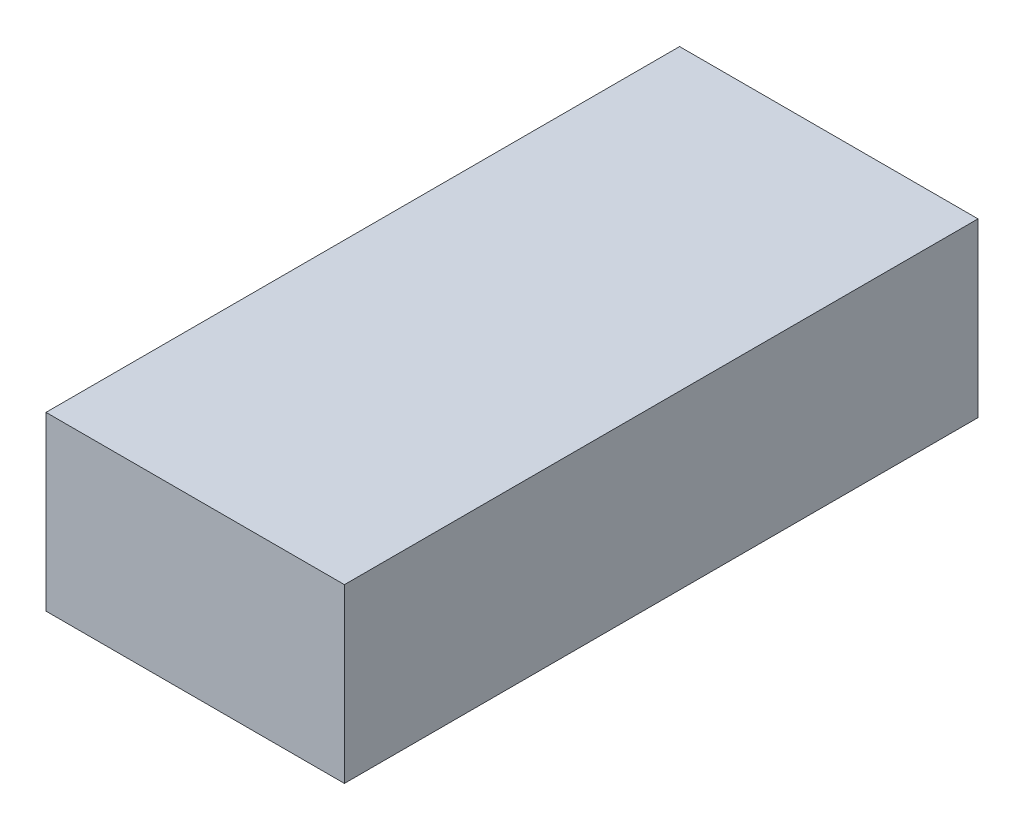
ISO-10303-21;
HEADER;
FILE_DESCRIPTION(('STEP AP214'),'2;1');
FILE_NAME('part.step','',(''),(''),'','','');
FILE_SCHEMA(('AUTOMOTIVE_DESIGN { 1 0 10303 214 1 1 1 1 }'));
ENDSEC;
DATA;
#1=APPLICATION_CONTEXT('core data for automotive mechanical design processes');
#2=APPLICATION_PROTOCOL_DEFINITION('international standard','automotive_design',2000,#1);
#3=PRODUCT_CONTEXT('',#1,'mechanical');
#4=PRODUCT('Part','Part','',(#3));
#5=PRODUCT_RELATED_PRODUCT_CATEGORY('part','',(#4));
#6=PRODUCT_DEFINITION_FORMATION('','',#4);
#7=PRODUCT_DEFINITION_CONTEXT('part definition',#1,'design');
#8=PRODUCT_DEFINITION('design','',#6,#7);
#9=PRODUCT_DEFINITION_SHAPE('','',#8);
#10=(LENGTH_UNIT() NAMED_UNIT(*) SI_UNIT(.MILLI.,.METRE.));
#11=(NAMED_UNIT(*) PLANE_ANGLE_UNIT() SI_UNIT($,.RADIAN.));
#12=(NAMED_UNIT(*) SI_UNIT($,.STERADIAN.) SOLID_ANGLE_UNIT());
#13=UNCERTAINTY_MEASURE_WITH_UNIT(LENGTH_MEASURE(1.E-05),#10,'distance_accuracy_value','');
#14=(GEOMETRIC_REPRESENTATION_CONTEXT(3) GLOBAL_UNCERTAINTY_ASSIGNED_CONTEXT((#13)) GLOBAL_UNIT_ASSIGNED_CONTEXT((#10,
#11,#12)) REPRESENTATION_CONTEXT('',''));
#15=CARTESIAN_POINT('',(0.,0.,0.));
#16=DIRECTION('',(0.,0.,1.));
#17=DIRECTION('',(1.,0.,0.));
#18=AXIS2_PLACEMENT_3D('',#15,#16,#17);
#19=CARTESIAN_POINT('',(0.,19.05,0.));
#20=DIRECTION('',(1.,0.,0.));
#21=DIRECTION('',(0.,0.,-1.));
#22=AXIS2_PLACEMENT_3D('',#19,#20,#21);
#23=PLANE('',#22);
#24=DIRECTION('',(0.,0.,1.));
#25=VECTOR('',#24,1.);
#26=CARTESIAN_POINT('',(0.,0.,0.));
#27=LINE('',#26,#25);
#28=CARTESIAN_POINT('',(0.,0.,-70.104));
#29=VERTEX_POINT('',#28);
#30=CARTESIAN_POINT('',(0.,0.,0.));
#31=VERTEX_POINT('',#30);
#32=EDGE_CURVE('E101',#29,#31,#27,.T.);
#33=ORIENTED_EDGE('',*,*,#32,.T.);
#34=DIRECTION('',(0.,-1.,0.));
#35=VECTOR('',#34,1.);
#36=CARTESIAN_POINT('',(0.,19.05,0.));
#37=LINE('',#36,#35);
#38=CARTESIAN_POINT('',(0.,19.05,0.));
#39=VERTEX_POINT('',#38);
#40=EDGE_CURVE('E11',#39,#31,#37,.T.);
#41=ORIENTED_EDGE('',*,*,#40,.F.);
#42=DIRECTION('',(0.,0.,1.));
#43=VECTOR('',#42,1.);
#44=CARTESIAN_POINT('',(0.,19.05,0.));
#45=LINE('',#44,#43);
#46=CARTESIAN_POINT('',(0.,19.05,-70.104));
#47=VERTEX_POINT('',#46);
#48=EDGE_CURVE('E89',#47,#39,#45,.T.);
#49=ORIENTED_EDGE('',*,*,#48,.F.);
#50=DIRECTION('',(0.,-1.,0.));
#51=VECTOR('',#50,1.);
#52=CARTESIAN_POINT('',(0.,19.05,-70.104));
#53=LINE('',#52,#51);
#54=EDGE_CURVE('E97',#47,#29,#53,.T.);
#55=ORIENTED_EDGE('',*,*,#54,.T.);
#56=EDGE_LOOP('',(#33,#41,#49,#55));
#57=FACE_BOUND('',#56,.T.);
#58=ADVANCED_FACE('F38',(#57),#23,.F.);
#59=CARTESIAN_POINT('',(0.,19.05,0.));
#60=DIRECTION('',(0.,0.,-1.));
#61=DIRECTION('',(-1.,0.,0.));
#62=AXIS2_PLACEMENT_3D('',#59,#60,#61);
#63=PLANE('',#62);
#64=DIRECTION('',(1.,0.,0.));
#65=VECTOR('',#64,1.);
#66=CARTESIAN_POINT('',(0.,0.,0.));
#67=LINE('',#66,#65);
#68=CARTESIAN_POINT('',(33.02,0.,0.));
#69=VERTEX_POINT('',#68);
#70=EDGE_CURVE('E93',#31,#69,#67,.T.);
#71=ORIENTED_EDGE('',*,*,#70,.T.);
#72=DIRECTION('',(0.,-1.,0.));
#73=VECTOR('',#72,1.);
#74=CARTESIAN_POINT('',(33.02,19.05,0.));
#75=LINE('',#74,#73);
#76=CARTESIAN_POINT('',(33.02,19.05,0.));
#77=VERTEX_POINT('',#76);
#78=EDGE_CURVE('E46',#77,#69,#75,.T.);
#79=ORIENTED_EDGE('',*,*,#78,.F.);
#80=DIRECTION('',(1.,0.,0.));
#81=VECTOR('',#80,1.);
#82=CARTESIAN_POINT('',(0.,19.05,0.));
#83=LINE('',#82,#81);
#84=EDGE_CURVE('E84',#39,#77,#83,.T.);
#85=ORIENTED_EDGE('',*,*,#84,.F.);
#86=ORIENTED_EDGE('',*,*,#40,.T.);
#87=EDGE_LOOP('',(#71,#79,#85,#86));
#88=FACE_BOUND('',#87,.T.);
#89=ADVANCED_FACE('F92',(#88),#63,.F.);
#90=CARTESIAN_POINT('',(33.02,19.05,0.));
#91=DIRECTION('',(-1.,0.,0.));
#92=DIRECTION('',(0.,0.,1.));
#93=AXIS2_PLACEMENT_3D('',#90,#91,#92);
#94=PLANE('',#93);
#95=DIRECTION('',(0.,0.,-1.));
#96=VECTOR('',#95,1.);
#97=CARTESIAN_POINT('',(33.02,0.,0.));
#98=LINE('',#97,#96);
#99=CARTESIAN_POINT('',(33.02,0.,-70.104));
#100=VERTEX_POINT('',#99);
#101=EDGE_CURVE('E71',#69,#100,#98,.T.);
#102=ORIENTED_EDGE('',*,*,#101,.T.);
#103=DIRECTION('',(0.,-1.,0.));
#104=VECTOR('',#103,1.);
#105=CARTESIAN_POINT('',(33.02,19.05,-70.104));
#106=LINE('',#105,#104);
#107=CARTESIAN_POINT('',(33.02,19.05,-70.104));
#108=VERTEX_POINT('',#107);
#109=EDGE_CURVE('E94',#108,#100,#106,.T.);
#110=ORIENTED_EDGE('',*,*,#109,.F.);
#111=DIRECTION('',(0.,0.,-1.));
#112=VECTOR('',#111,1.);
#113=CARTESIAN_POINT('',(33.02,19.05,0.));
#114=LINE('',#113,#112);
#115=EDGE_CURVE('E87',#77,#108,#114,.T.);
#116=ORIENTED_EDGE('',*,*,#115,.F.);
#117=ORIENTED_EDGE('',*,*,#78,.T.);
#118=EDGE_LOOP('',(#102,#110,#116,#117));
#119=FACE_BOUND('',#118,.T.);
#120=ADVANCED_FACE('F95',(#119),#94,.F.);
#121=CARTESIAN_POINT('',(0.,19.05,-70.104));
#122=DIRECTION('',(0.,0.,1.));
#123=DIRECTION('',(1.,0.,0.));
#124=AXIS2_PLACEMENT_3D('',#121,#122,#123);
#125=PLANE('',#124);
#126=DIRECTION('',(-1.,0.,0.));
#127=VECTOR('',#126,1.);
#128=CARTESIAN_POINT('',(0.,0.,-70.104));
#129=LINE('',#128,#127);
#130=EDGE_CURVE('E77',#100,#29,#129,.T.);
#131=ORIENTED_EDGE('',*,*,#130,.T.);
#132=ORIENTED_EDGE('',*,*,#54,.F.);
#133=DIRECTION('',(-1.,0.,0.));
#134=VECTOR('',#133,1.);
#135=CARTESIAN_POINT('',(0.,19.05,-70.104));
#136=LINE('',#135,#134);
#137=EDGE_CURVE('E54',#108,#47,#136,.T.);
#138=ORIENTED_EDGE('',*,*,#137,.F.);
#139=ORIENTED_EDGE('',*,*,#109,.T.);
#140=EDGE_LOOP('',(#131,#132,#138,#139));
#141=FACE_BOUND('',#140,.T.);
#142=ADVANCED_FACE('F108',(#141),#125,.F.);
#143=CARTESIAN_POINT('',(0.,19.05,0.));
#144=DIRECTION('',(0.,-1.,0.));
#145=DIRECTION('',(0.,0.,-1.));
#146=AXIS2_PLACEMENT_3D('',#143,#144,#145);
#147=PLANE('',#146);
#148=ORIENTED_EDGE('',*,*,#48,.T.);
#149=ORIENTED_EDGE('',*,*,#84,.T.);
#150=ORIENTED_EDGE('',*,*,#115,.T.);
#151=ORIENTED_EDGE('',*,*,#137,.T.);
#152=EDGE_LOOP('',(#148,#149,#150,#151));
#153=FACE_BOUND('',#152,.T.);
#154=ADVANCED_FACE('F85',(#153),#147,.F.);
#155=CARTESIAN_POINT('',(0.,0.,0.));
#156=DIRECTION('',(0.,-1.,0.));
#157=DIRECTION('',(0.,0.,-1.));
#158=AXIS2_PLACEMENT_3D('',#155,#156,#157);
#159=PLANE('',#158);
#160=ORIENTED_EDGE('',*,*,#32,.F.);
#161=ORIENTED_EDGE('',*,*,#130,.F.);
#162=ORIENTED_EDGE('',*,*,#101,.F.);
#163=ORIENTED_EDGE('',*,*,#70,.F.);
#164=EDGE_LOOP('',(#160,#161,#162,#163));
#165=FACE_BOUND('',#164,.T.);
#166=ADVANCED_FACE('F111',(#165),#159,.T.);
#167=CLOSED_SHELL('',(#58,#89,#120,#142,#154,#166));
#168=MANIFOLD_SOLID_BREP('B2',#167);
#169=ADVANCED_BREP_SHAPE_REPRESENTATION('',(#18,#168),#14);
#170=SHAPE_DEFINITION_REPRESENTATION(#9,#169);
ENDSEC;
END-ISO-10303-21;
